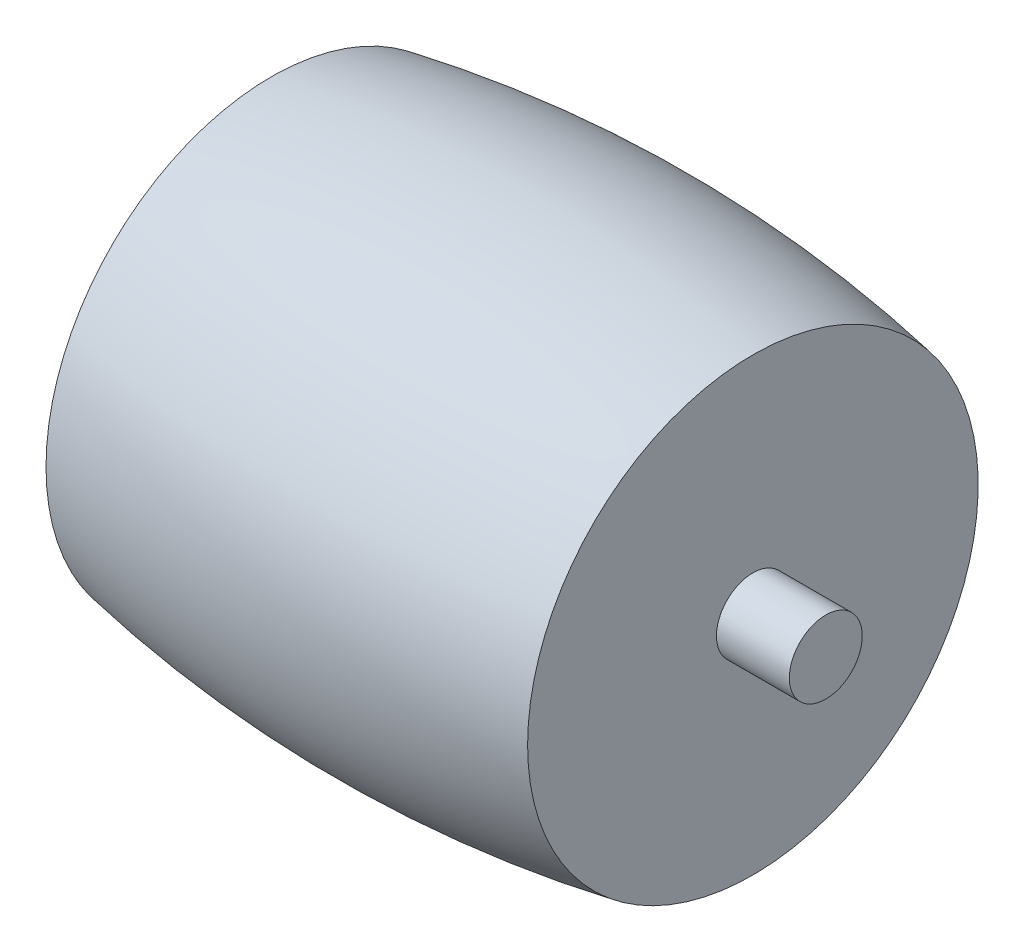
ISO-10303-21;
HEADER;
FILE_DESCRIPTION(('STEP AP214'),'2;1');
FILE_NAME('part.step','',(''),(''),'','','');
FILE_SCHEMA(('AUTOMOTIVE_DESIGN { 1 0 10303 214 1 1 1 1 }'));
ENDSEC;
DATA;
#1=APPLICATION_CONTEXT('core data for automotive mechanical design processes');
#2=APPLICATION_PROTOCOL_DEFINITION('international standard','automotive_design',2000,#1);
#3=PRODUCT_CONTEXT('',#1,'mechanical');
#4=PRODUCT('Part','Part','',(#3));
#5=PRODUCT_RELATED_PRODUCT_CATEGORY('part','',(#4));
#6=PRODUCT_DEFINITION_FORMATION('','',#4);
#7=PRODUCT_DEFINITION_CONTEXT('part definition',#1,'design');
#8=PRODUCT_DEFINITION('design','',#6,#7);
#9=PRODUCT_DEFINITION_SHAPE('','',#8);
#10=(LENGTH_UNIT() NAMED_UNIT(*) SI_UNIT(.MILLI.,.METRE.));
#11=(NAMED_UNIT(*) PLANE_ANGLE_UNIT() SI_UNIT($,.RADIAN.));
#12=(NAMED_UNIT(*) SI_UNIT($,.STERADIAN.) SOLID_ANGLE_UNIT());
#13=UNCERTAINTY_MEASURE_WITH_UNIT(LENGTH_MEASURE(1.E-05),#10,'distance_accuracy_value','');
#14=(GEOMETRIC_REPRESENTATION_CONTEXT(3) GLOBAL_UNCERTAINTY_ASSIGNED_CONTEXT((#13)) GLOBAL_UNIT_ASSIGNED_CONTEXT((#10,
#11,#12)) REPRESENTATION_CONTEXT('',''));
#15=CARTESIAN_POINT('',(0.,0.,0.));
#16=DIRECTION('',(0.,0.,1.));
#17=DIRECTION('',(1.,0.,0.));
#18=AXIS2_PLACEMENT_3D('',#15,#16,#17);
#19=CARTESIAN_POINT('',(-9.25,41.5,0.));
#20=DIRECTION('',(-1.,0.,0.));
#21=DIRECTION('',(0.,0.,1.));
#22=AXIS2_PLACEMENT_3D('',#19,#20,#21);
#23=CYLINDRICAL_SURFACE('',#22,1.4);
#24=CARTESIAN_POINT('',(9.25,41.5,0.));
#25=DIRECTION('',(-1.,0.,0.));
#26=DIRECTION('',(0.,0.,1.));
#27=AXIS2_PLACEMENT_3D('',#24,#25,#26);
#28=CIRCLE('',#27,1.4);
#29=CARTESIAN_POINT('',(9.25,41.5,1.4));
#30=VERTEX_POINT('',#29);
#31=EDGE_CURVE('E10',#30,#30,#28,.T.);
#32=ORIENTED_EDGE('',*,*,#31,.F.);
#33=EDGE_LOOP('',(#32));
#34=FACE_BOUND('',#33,.T.);
#35=CARTESIAN_POINT('',(12.05,41.5,0.));
#36=DIRECTION('',(-1.,0.,0.));
#37=DIRECTION('',(0.,0.,1.));
#38=AXIS2_PLACEMENT_3D('',#35,#36,#37);
#39=CIRCLE('',#38,1.4);
#40=CARTESIAN_POINT('',(12.05,41.5,1.4));
#41=VERTEX_POINT('',#40);
#42=EDGE_CURVE('E50',#41,#41,#39,.T.);
#43=ORIENTED_EDGE('',*,*,#42,.T.);
#44=EDGE_LOOP('',(#43));
#45=FACE_BOUND('',#44,.T.);
#46=ADVANCED_FACE('F28',(#34,#45),#23,.T.);
#47=CARTESIAN_POINT('',(9.25,50.1541374165681,0.));
#48=DIRECTION('',(-1.,0.,0.));
#49=DIRECTION('',(0.,0.,1.));
#50=AXIS2_PLACEMENT_3D('',#47,#48,#49);
#51=PLANE('',#50);
#52=CARTESIAN_POINT('',(9.25,41.5,0.));
#53=DIRECTION('',(-1.,0.,0.));
#54=DIRECTION('',(0.,0.,1.));
#55=AXIS2_PLACEMENT_3D('',#52,#53,#54);
#56=CIRCLE('',#55,8.65413741656814);
#57=CARTESIAN_POINT('',(9.25,41.5,8.65413741656814));
#58=VERTEX_POINT('',#57);
#59=EDGE_CURVE('E34',#58,#58,#56,.T.);
#60=ORIENTED_EDGE('',*,*,#59,.F.);
#61=EDGE_LOOP('',(#60));
#62=FACE_BOUND('',#61,.T.);
#63=ORIENTED_EDGE('',*,*,#31,.T.);
#64=EDGE_LOOP('',(#63));
#65=FACE_BOUND('',#64,.T.);
#66=ADVANCED_FACE('F66',(#62,#65),#51,.F.);
#67=CARTESIAN_POINT('',(0.,41.5,0.));
#68=DIRECTION('',(-1.,0.,0.));
#69=DIRECTION('',(0.,0.,1.));
#70=AXIS2_PLACEMENT_3D('',#67,#68,#69);
#71=DEGENERATE_TOROIDAL_SURFACE('',#70,41.5,51.,.F.);
#72=CARTESIAN_POINT('',(-9.25,41.5,0.));
#73=DIRECTION('',(-1.,0.,0.));
#74=DIRECTION('',(0.,0.,1.));
#75=AXIS2_PLACEMENT_3D('',#72,#73,#74);
#76=CIRCLE('',#75,8.65413741656814);
#77=CARTESIAN_POINT('',(-9.25,41.5,8.65413741656814));
#78=VERTEX_POINT('',#77);
#79=EDGE_CURVE('E38',#78,#78,#76,.T.);
#80=ORIENTED_EDGE('',*,*,#79,.F.);
#81=EDGE_LOOP('',(#80));
#82=FACE_BOUND('',#81,.T.);
#83=ORIENTED_EDGE('',*,*,#59,.T.);
#84=EDGE_LOOP('',(#83));
#85=FACE_BOUND('',#84,.T.);
#86=ADVANCED_FACE('F71',(#82,#85),#71,.F.);
#87=CARTESIAN_POINT('',(-9.25,50.1541374165681,0.));
#88=DIRECTION('',(1.,0.,0.));
#89=DIRECTION('',(0.,0.,-1.));
#90=AXIS2_PLACEMENT_3D('',#87,#88,#89);
#91=PLANE('',#90);
#92=CARTESIAN_POINT('',(-9.25,41.5,0.));
#93=DIRECTION('',(-1.,0.,0.));
#94=DIRECTION('',(0.,0.,1.));
#95=AXIS2_PLACEMENT_3D('',#92,#93,#94);
#96=CIRCLE('',#95,1.4);
#97=CARTESIAN_POINT('',(-9.25,41.5,1.4));
#98=VERTEX_POINT('',#97);
#99=EDGE_CURVE('E42',#98,#98,#96,.T.);
#100=ORIENTED_EDGE('',*,*,#99,.F.);
#101=EDGE_LOOP('',(#100));
#102=FACE_BOUND('',#101,.T.);
#103=ORIENTED_EDGE('',*,*,#79,.T.);
#104=EDGE_LOOP('',(#103));
#105=FACE_BOUND('',#104,.T.);
#106=ADVANCED_FACE('F76',(#102,#105),#91,.F.);
#107=CARTESIAN_POINT('',(-9.25,41.5,0.));
#108=DIRECTION('',(-1.,0.,0.));
#109=DIRECTION('',(0.,0.,1.));
#110=AXIS2_PLACEMENT_3D('',#107,#108,#109);
#111=CYLINDRICAL_SURFACE('',#110,1.4);
#112=CARTESIAN_POINT('',(-12.05,41.5,0.));
#113=DIRECTION('',(-1.,0.,0.));
#114=DIRECTION('',(0.,0.,1.));
#115=AXIS2_PLACEMENT_3D('',#112,#113,#114);
#116=CIRCLE('',#115,1.4);
#117=CARTESIAN_POINT('',(-12.05,41.5,1.4));
#118=VERTEX_POINT('',#117);
#119=EDGE_CURVE('E47',#118,#118,#116,.T.);
#120=ORIENTED_EDGE('',*,*,#119,.F.);
#121=EDGE_LOOP('',(#120));
#122=FACE_BOUND('',#121,.T.);
#123=ORIENTED_EDGE('',*,*,#99,.T.);
#124=EDGE_LOOP('',(#123));
#125=FACE_BOUND('',#124,.T.);
#126=ADVANCED_FACE('F62',(#122,#125),#111,.T.);
#127=CARTESIAN_POINT('',(-12.05,42.9,0.));
#128=DIRECTION('',(1.,0.,0.));
#129=DIRECTION('',(0.,0.,-1.));
#130=AXIS2_PLACEMENT_3D('',#127,#128,#129);
#131=PLANE('',#130);
#132=ORIENTED_EDGE('',*,*,#119,.T.);
#133=EDGE_LOOP('',(#132));
#134=FACE_BOUND('',#133,.T.);
#135=ADVANCED_FACE('F57',(#134),#131,.F.);
#136=CARTESIAN_POINT('',(12.05,42.9,0.));
#137=DIRECTION('',(-1.,0.,0.));
#138=DIRECTION('',(0.,0.,1.));
#139=AXIS2_PLACEMENT_3D('',#136,#137,#138);
#140=PLANE('',#139);
#141=ORIENTED_EDGE('',*,*,#42,.F.);
#142=EDGE_LOOP('',(#141));
#143=FACE_BOUND('',#142,.T.);
#144=ADVANCED_FACE('F55',(#143),#140,.F.);
#145=CLOSED_SHELL('',(#46,#66,#86,#106,#126,#135,#144));
#146=MANIFOLD_SOLID_BREP('B2',#145);
#147=ADVANCED_BREP_SHAPE_REPRESENTATION('',(#18,#146),#14);
#148=SHAPE_DEFINITION_REPRESENTATION(#9,#147);
ENDSEC;
END-ISO-10303-21;
